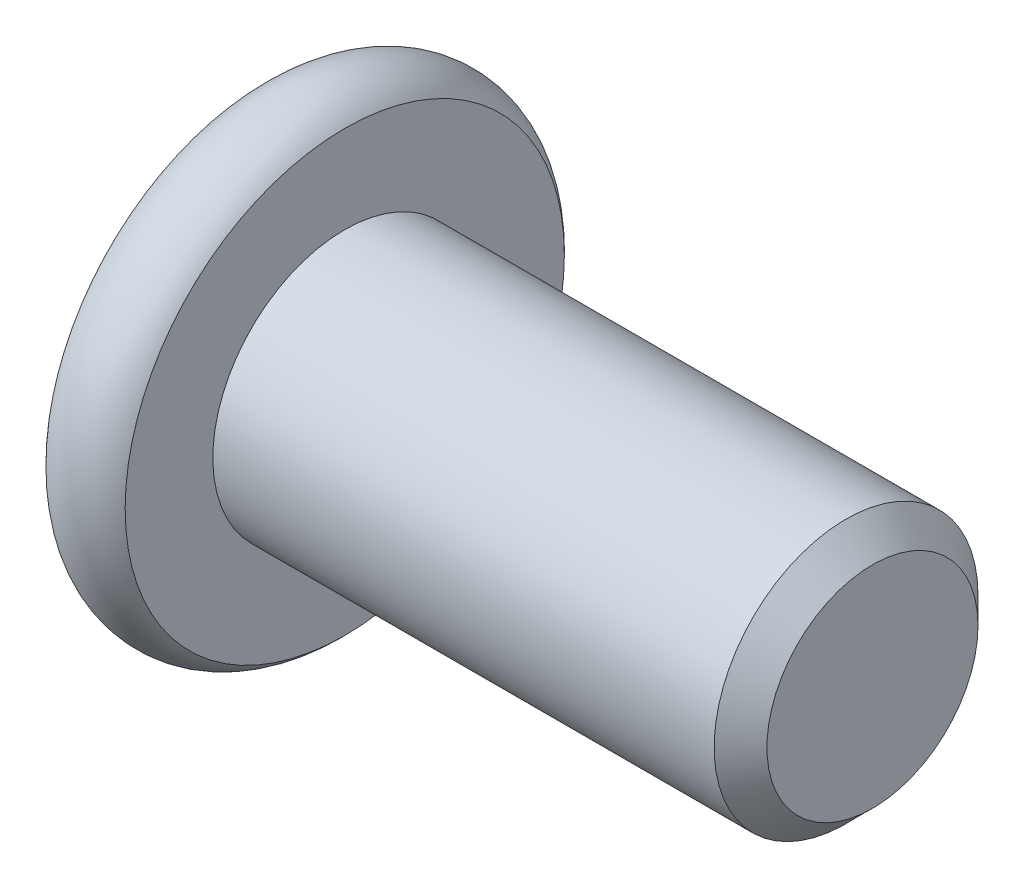
ISO-10303-21;
HEADER;
FILE_DESCRIPTION(('STEP AP214'),'2;1');
FILE_NAME('part.step','',(''),(''),'','','');
FILE_SCHEMA(('AUTOMOTIVE_DESIGN { 1 0 10303 214 1 1 1 1 }'));
ENDSEC;
DATA;
#1=APPLICATION_CONTEXT('core data for automotive mechanical design processes');
#2=APPLICATION_PROTOCOL_DEFINITION('international standard','automotive_design',2000,#1);
#3=PRODUCT_CONTEXT('',#1,'mechanical');
#4=PRODUCT('Part','Part','',(#3));
#5=PRODUCT_RELATED_PRODUCT_CATEGORY('part','',(#4));
#6=PRODUCT_DEFINITION_FORMATION('','',#4);
#7=PRODUCT_DEFINITION_CONTEXT('part definition',#1,'design');
#8=PRODUCT_DEFINITION('design','',#6,#7);
#9=PRODUCT_DEFINITION_SHAPE('','',#8);
#10=(LENGTH_UNIT() NAMED_UNIT(*) SI_UNIT(.MILLI.,.METRE.));
#11=(NAMED_UNIT(*) PLANE_ANGLE_UNIT() SI_UNIT($,.RADIAN.));
#12=(NAMED_UNIT(*) SI_UNIT($,.STERADIAN.) SOLID_ANGLE_UNIT());
#13=UNCERTAINTY_MEASURE_WITH_UNIT(LENGTH_MEASURE(1.E-05),#10,'distance_accuracy_value','');
#14=(GEOMETRIC_REPRESENTATION_CONTEXT(3) GLOBAL_UNCERTAINTY_ASSIGNED_CONTEXT((#13)) GLOBAL_UNIT_ASSIGNED_CONTEXT((#10,
#11,#12)) REPRESENTATION_CONTEXT('',''));
#15=CARTESIAN_POINT('',(0.,0.,0.));
#16=DIRECTION('',(0.,0.,1.));
#17=DIRECTION('',(1.,0.,0.));
#18=AXIS2_PLACEMENT_3D('',#15,#16,#17);
#19=CARTESIAN_POINT('',(-10.,0.,1.11022302462516E-13));
#20=DIRECTION('',(1.,0.,0.));
#21=DIRECTION('',(0.,0.,-1.));
#22=AXIS2_PLACEMENT_3D('',#19,#20,#21);
#23=CYLINDRICAL_SURFACE('',#22,2.5);
#24=CARTESIAN_POINT('',(-0.5,0.,0.));
#25=DIRECTION('',(1.,0.,0.));
#26=DIRECTION('',(0.,0.,-1.));
#27=AXIS2_PLACEMENT_3D('',#24,#25,#26);
#28=CIRCLE('',#27,2.5);
#29=CARTESIAN_POINT('',(-0.5,0.,-2.5));
#30=VERTEX_POINT('',#29);
#31=EDGE_CURVE('E59',#30,#30,#28,.F.);
#32=ORIENTED_EDGE('',*,*,#31,.T.);
#33=EDGE_LOOP('',(#32));
#34=FACE_BOUND('',#33,.T.);
#35=CARTESIAN_POINT('',(-10.,0.,1.11022302462516E-13));
#36=DIRECTION('',(1.,0.,0.));
#37=DIRECTION('',(0.,1.,0.));
#38=AXIS2_PLACEMENT_3D('',#35,#36,#37);
#39=CIRCLE('',#38,2.5);
#40=CARTESIAN_POINT('',(-10.,2.49999999999997,1.09495745803656E-13));
#41=VERTEX_POINT('',#40);
#42=EDGE_CURVE('E135',#41,#41,#39,.F.);
#43=ORIENTED_EDGE('',*,*,#42,.F.);
#44=EDGE_LOOP('',(#43));
#45=FACE_BOUND('',#44,.T.);
#46=ADVANCED_FACE('F45',(#34,#45),#23,.T.);
#47=CARTESIAN_POINT('',(0.,0.,0.));
#48=DIRECTION('',(1.,0.,0.));
#49=DIRECTION('',(0.,0.,-1.));
#50=AXIS2_PLACEMENT_3D('',#47,#48,#49);
#51=PLANE('',#50);
#52=CARTESIAN_POINT('',(0.,0.,0.));
#53=DIRECTION('',(1.,0.,0.));
#54=DIRECTION('',(0.,0.,-1.));
#55=AXIS2_PLACEMENT_3D('',#52,#53,#54);
#56=CIRCLE('',#55,1.99999999999999);
#57=CARTESIAN_POINT('',(0.,0.,-1.99999999999999));
#58=VERTEX_POINT('',#57);
#59=EDGE_CURVE('E138',#58,#58,#56,.T.);
#60=ORIENTED_EDGE('',*,*,#59,.T.);
#61=EDGE_LOOP('',(#60));
#62=FACE_BOUND('',#61,.T.);
#63=ADVANCED_FACE('F148',(#62),#51,.T.);
#64=CARTESIAN_POINT('',(0.,0.,0.));
#65=DIRECTION('',(-1.,0.,0.));
#66=DIRECTION('',(0.,0.,1.));
#67=AXIS2_PLACEMENT_3D('',#64,#65,#66);
#68=CONICAL_SURFACE('',#67,1.99999999999999,0.785398163397446);
#69=ORIENTED_EDGE('',*,*,#31,.F.);
#70=EDGE_LOOP('',(#69));
#71=FACE_BOUND('',#70,.T.);
#72=ORIENTED_EDGE('',*,*,#59,.F.);
#73=EDGE_LOOP('',(#72));
#74=FACE_BOUND('',#73,.T.);
#75=ADVANCED_FACE('F47',(#71,#74),#68,.T.);
#76=CARTESIAN_POINT('',(-11.5,0.,1.11022302462516E-13));
#77=DIRECTION('',(-1.,0.,0.));
#78=DIRECTION('',(0.,-1.,0.));
#79=AXIS2_PLACEMENT_3D('',#76,#77,#78);
#80=PLANE('',#79);
#81=CARTESIAN_POINT('',(-11.5,0.,0.));
#82=DIRECTION('',(-1.,0.,0.));
#83=DIRECTION('',(0.,-1.,0.));
#84=AXIS2_PLACEMENT_3D('',#81,#82,#83);
#85=CIRCLE('',#84,1.78205080756886);
#86=CARTESIAN_POINT('',(-11.5,-1.78205080756884,0.));
#87=VERTEX_POINT('',#86);
#88=EDGE_CURVE('E253',#87,#87,#85,.T.);
#89=ORIENTED_EDGE('',*,*,#88,.F.);
#90=EDGE_LOOP('',(#89));
#91=FACE_BOUND('',#90,.T.);
#92=CARTESIAN_POINT('',(-11.5,0.,1.11022302462516E-13));
#93=DIRECTION('',(1.,0.,0.));
#94=DIRECTION('',(0.,1.,0.));
#95=AXIS2_PLACEMENT_3D('',#92,#93,#94);
#96=CIRCLE('',#95,4.16143782776615);
#97=CARTESIAN_POINT('',(-11.5,4.16143782776612,1.08481234211953E-13));
#98=VERTEX_POINT('',#97);
#99=EDGE_CURVE('E132',#98,#98,#96,.T.);
#100=ORIENTED_EDGE('',*,*,#99,.F.);
#101=EDGE_LOOP('',(#100));
#102=FACE_BOUND('',#101,.T.);
#103=ADVANCED_FACE('F147',(#91,#102),#80,.T.);
#104=CARTESIAN_POINT('',(-10.75,0.,1.11022302462516E-13));
#105=DIRECTION('',(1.,0.,0.));
#106=DIRECTION('',(0.,1.,0.));
#107=AXIS2_PLACEMENT_3D('',#104,#105,#106);
#108=TOROIDAL_SURFACE('',#107,3.5,1.);
#109=ORIENTED_EDGE('',*,*,#99,.T.);
#110=EDGE_LOOP('',(#109));
#111=FACE_BOUND('',#110,.T.);
#112=CARTESIAN_POINT('',(-10.,0.,1.11022302462516E-13));
#113=DIRECTION('',(1.,0.,0.));
#114=DIRECTION('',(0.,1.,0.));
#115=AXIS2_PLACEMENT_3D('',#112,#113,#114);
#116=CIRCLE('',#115,4.16143782776615);
#117=CARTESIAN_POINT('',(-10.,4.16143782776612,1.08481234211953E-13));
#118=VERTEX_POINT('',#117);
#119=EDGE_CURVE('E129',#118,#118,#116,.T.);
#120=ORIENTED_EDGE('',*,*,#119,.F.);
#121=EDGE_LOOP('',(#120));
#122=FACE_BOUND('',#121,.T.);
#123=ADVANCED_FACE('F159',(#111,#122),#108,.T.);
#124=CARTESIAN_POINT('',(-10.,4.16143782776604,0.));
#125=DIRECTION('',(1.,0.,0.));
#126=DIRECTION('',(0.,1.,0.));
#127=AXIS2_PLACEMENT_3D('',#124,#125,#126);
#128=PLANE('',#127);
#129=ORIENTED_EDGE('',*,*,#42,.T.);
#130=EDGE_LOOP('',(#129));
#131=FACE_BOUND('',#130,.T.);
#132=ORIENTED_EDGE('',*,*,#119,.T.);
#133=EDGE_LOOP('',(#132));
#134=FACE_BOUND('',#133,.T.);
#135=ADVANCED_FACE('F163',(#131,#134),#128,.T.);
#136=CARTESIAN_POINT('',(-11.5,0.,0.));
#137=DIRECTION('',(-1.,0.,0.));
#138=DIRECTION('',(0.,-1.,0.));
#139=AXIS2_PLACEMENT_3D('',#136,#137,#138);
#140=CONICAL_SURFACE('',#139,1.78205080756886,0.78539816339745);
#141=ORIENTED_EDGE('',*,*,#88,.T.);
#142=EDGE_LOOP('',(#141));
#143=FACE_BOUND('',#142,.T.);
#144=CARTESIAN_POINT('',(-12.015428085613,-1.74023253176575,1.50000000000006));
#145=CARTESIAN_POINT('',(-11.9833811073445,-1.69791724929728,1.50000000000006));
#146=CARTESIAN_POINT('',(-11.9516444672841,-1.65536760966789,1.50000000000006));
#147=CARTESIAN_POINT('',(-11.8889203936153,-1.56970398156682,1.50000000000006));
#148=CARTESIAN_POINT('',(-11.85793314822,-1.52658985542846,1.50000000000006));
#149=CARTESIAN_POINT('',(-11.765846164345,-1.3956262632656,1.50000000000005));
#150=CARTESIAN_POINT('',(-11.7061145123022,-1.30679868010573,1.50000000000005));
#151=CARTESIAN_POINT('',(-11.5887342891013,-1.12044622640211,1.50000000000007));
#152=CARTESIAN_POINT('',(-11.5314082774823,-1.02271587306667,1.5000000000001));
#153=CARTESIAN_POINT('',(-11.426463214976,-0.822357214965205,1.50000000000001));
#154=CARTESIAN_POINT('',(-11.3788114236896,-0.719746931701875,1.49999999999989));
#155=CARTESIAN_POINT('',(-11.3205099883151,-0.565852387095046,1.49999999999997));
#156=CARTESIAN_POINT('',(-11.303799053541,-0.516874191424634,1.50000000000003));
#157=CARTESIAN_POINT('',(-11.274307751509,-0.417723988457477,1.50000000000008));
#158=CARTESIAN_POINT('',(-11.261527651422,-0.367551900263847,1.50000000000006));
#159=CARTESIAN_POINT('',(-11.2407784202458,-0.267158299056105,1.50000000000005));
#160=CARTESIAN_POINT('',(-11.232726061826,-0.216954261864843,1.50000000000006));
#161=CARTESIAN_POINT('',(-11.2215916368341,-0.115994915871321,1.50000000000006));
#162=CARTESIAN_POINT('',(-11.2185086886377,-0.0652397064615481,1.50000000000006));
#163=CARTESIAN_POINT('',(-11.2175473897404,0.0344222234875365,1.50000000000006));
#164=CARTESIAN_POINT('',(-11.2194789216952,0.0833271701100688,1.50000000000006));
#165=CARTESIAN_POINT('',(-11.2280175729678,0.180724293127204,1.50000000000006));
#166=CARTESIAN_POINT('',(-11.2346251420481,0.229216429361716,1.50000000000006));
#167=CARTESIAN_POINT('',(-11.2522650626448,0.326258027696999,1.50000000000006));
#168=CARTESIAN_POINT('',(-11.2633731682011,0.374793507450018,1.50000000000006));
#169=CARTESIAN_POINT('',(-11.2894198669596,0.470802295834187,1.50000000000006));
#170=CARTESIAN_POINT('',(-11.3043581560035,0.518275688481306,1.50000000000006));
#171=CARTESIAN_POINT('',(-11.3568395457159,0.667150562065167,1.50000000000006));
#172=CARTESIAN_POINT('',(-11.4003351165442,0.766448362426846,1.50000000000006));
#173=CARTESIAN_POINT('',(-11.4970587814837,0.960384405673804,1.50000000000006));
#174=CARTESIAN_POINT('',(-11.5503217226675,1.05500437383619,1.50000000000006));
#175=CARTESIAN_POINT('',(-11.6602258010454,1.23584520321531,1.50000000000006));
#176=CARTESIAN_POINT('',(-11.7165682531047,1.32224986946549,1.50000000000006));
#177=CARTESIAN_POINT('',(-11.8036755725971,1.44954953726472,1.50000000000006));
#178=CARTESIAN_POINT('',(-11.8330199906839,1.49143368482422,1.50000000000006));
#179=CARTESIAN_POINT('',(-11.8924869182931,1.57462914783243,1.50000000000006));
#180=CARTESIAN_POINT('',(-11.9226092115008,1.61594061772578,1.50000000000006));
#181=CARTESIAN_POINT('',(-11.9530541181365,1.65701358742554,1.50000000000006));
#182=B_SPLINE_CURVE_WITH_KNOTS('',3,(#144,#145,#146,#147,#148,#149,#150,#151,#152,#153,#154,
#155,#156,#157,#158,#159,#160,#161,#162,#163,#164,#165,#166,#167,#168,#169,#170,#171,#172,#173,
#174,#175,#176,#177,#178,#179,#180,#181),.UNSPECIFIED.,.F.,.F.,(4,2,2,2,2,2,2,2,2,2,2,2,2,2,2,2,
2,2,4),(0.,0.159238974218347,0.31851753501453,0.639504781932383,0.97913789379921,
1.31760168934358,1.47272233841623,1.62785352839774,1.78016486537344,1.93244917778274,
2.07904486260293,2.22565464958328,2.37484213303396,2.52401777304037,2.8482836528377,
3.17372975666746,3.48303030530534,3.63644667013904,3.78982082222906),.UNSPECIFIED.);
#183=CARTESIAN_POINT('',(-11.45,-0.866025403784415,1.50000000000006));
#184=VERTEX_POINT('',#183);
#185=CARTESIAN_POINT('',(-11.45,0.866025403784554,1.50000000000006));
#186=VERTEX_POINT('',#185);
#187=EDGE_CURVE('E113',#184,#186,#182,.T.);
#188=ORIENTED_EDGE('',*,*,#187,.F.);
#189=CARTESIAN_POINT('',(-11.4501154816001,-1.7321662776226,-0.000200000000005751));
#190=CARTESIAN_POINT('',(-11.4203654760673,-1.70239359975901,0.0513677907370204));
#191=CARTESIAN_POINT('',(-11.3923624839102,-1.67212305186341,0.103797917665136));
#192=CARTESIAN_POINT('',(-11.3410892304401,-1.61039789003607,0.210709034055522));
#193=CARTESIAN_POINT('',(-11.3178475050443,-1.57893740312603,0.265200195814587));
#194=CARTESIAN_POINT('',(-11.2780337289921,-1.51549879897974,0.37507908135714));
#195=CARTESIAN_POINT('',(-11.2613615856708,-1.48353684526794,0.430438809095058));
#196=CARTESIAN_POINT('',(-11.235674456818,-1.41890915196206,0.542377257477066));
#197=CARTESIAN_POINT('',(-11.2266402904789,-1.38624538781127,0.598952556553016));
#198=CARTESIAN_POINT('',(-11.2184890812268,-1.32995210095303,0.696455389516423));
#199=CARTESIAN_POINT('',(-11.2172822529891,-1.30639533311116,0.737256908280385));
#200=CARTESIAN_POINT('',(-11.2193140571621,-1.25932335290178,0.81878796961573));
#201=CARTESIAN_POINT('',(-11.2225536707482,-1.23580815085302,0.859517494314518));
#202=CARTESIAN_POINT('',(-11.2332919859819,-1.18900414978416,0.940584402163311));
#203=CARTESIAN_POINT('',(-11.2407946530186,-1.16571558211706,0.980921384598173));
#204=CARTESIAN_POINT('',(-11.2596516119282,-1.11952932016326,1.06091833691393));
#205=CARTESIAN_POINT('',(-11.2710075570186,-1.09663179808784,1.10057800851613));
#206=CARTESIAN_POINT('',(-11.3047216475927,-1.03798159809701,1.20216313477442));
#207=CARTESIAN_POINT('',(-11.3296218490933,-1.00259267147457,1.26345855370961));
#208=CARTESIAN_POINT('',(-11.3716566532715,-0.950557780604231,1.35358562846322));
#209=CARTESIAN_POINT('',(-11.386425153559,-0.933410759677002,1.38328513990763));
#210=CARTESIAN_POINT('',(-11.4173105659401,-0.899432101996304,1.44213790138367));
#211=CARTESIAN_POINT('',(-11.4334268341217,-0.882600319285652,1.47129140422057));
#212=CARTESIAN_POINT('',(-11.4501154816001,-0.865909933730619,1.50019999999995));
#213=B_SPLINE_CURVE_WITH_KNOTS('',3,(#189,#190,#191,#192,#193,#194,#195,#196,#197,#198,#199,
#200,#201,#202,#203,#204,#205,#206,#207,#208,#209,#210,#211,#212),.UNSPECIFIED.,.F.,.F.,(4,2,2,
2,2,2,2,2,2,2,2,4),(0.,0.199829143693317,0.400822987382368,0.598623720538134,0.79592624018884,
0.937113067959841,1.07833105577188,1.21968061668217,1.3610908993105,1.58570969637562,
1.6977070547096,1.80965120737191),.UNSPECIFIED.);
#214=CARTESIAN_POINT('',(-11.45,-1.73205080756877,-1.11022302462516E-13));
#215=VERTEX_POINT('',#214);
#216=EDGE_CURVE('E209',#215,#184,#213,.T.);
#217=ORIENTED_EDGE('',*,*,#216,.F.);
#218=CARTESIAN_POINT('',(-11.4501154816001,-0.865909933730619,-1.50020000000006));
#219=CARTESIAN_POINT('',(-11.4203654760674,-0.895682611594177,-1.44863220926296));
#220=CARTESIAN_POINT('',(-11.3923624839104,-0.925953159489773,-1.39620208233483));
#221=CARTESIAN_POINT('',(-11.3410892304402,-0.987678321317133,-1.28929096594443));
#222=CARTESIAN_POINT('',(-11.3178475050444,-1.01913880822719,-1.23479980418536));
#223=CARTESIAN_POINT('',(-11.2780337289923,-1.08257741237346,-1.12492091864276));
#224=CARTESIAN_POINT('',(-11.261361585671,-1.11453936608523,-1.0695611909048));
#225=CARTESIAN_POINT('',(-11.2356744568182,-1.17916705939123,-0.957622742522851));
#226=CARTESIAN_POINT('',(-11.2266402904789,-1.21183082354217,-0.901047443447003));
#227=CARTESIAN_POINT('',(-11.2184890812269,-1.26812411040036,-0.80354461048357));
#228=CARTESIAN_POINT('',(-11.2172822529893,-1.2916808782421,-0.762743091719539));
#229=CARTESIAN_POINT('',(-11.2193140571624,-1.3387528584514,-0.68121203038414));
#230=CARTESIAN_POINT('',(-11.2225536707484,-1.36226806050021,-0.640482505685366));
#231=CARTESIAN_POINT('',(-11.233291985982,-1.40907206156908,-0.559415597836582));
#232=CARTESIAN_POINT('',(-11.2407946530188,-1.43236062923615,-0.519078615401713));
#233=CARTESIAN_POINT('',(-11.2596516119284,-1.47854689118999,-0.439081663085956));
#234=CARTESIAN_POINT('',(-11.2710075570186,-1.50144441326547,-0.39942199148376));
#235=CARTESIAN_POINT('',(-11.3047216475927,-1.56009461325633,-0.297836865225488));
#236=CARTESIAN_POINT('',(-11.3296218490934,-1.59548353987867,-0.236541446290331));
#237=CARTESIAN_POINT('',(-11.3716566532716,-1.64751843074894,-0.146414371536733));
#238=CARTESIAN_POINT('',(-11.3864251535592,-1.66466545167616,-0.11671486009233));
#239=CARTESIAN_POINT('',(-11.4173105659402,-1.69864410935691,-0.05786209861631));
#240=CARTESIAN_POINT('',(-11.4334268341217,-1.71547589206762,-0.0287085957794369));
#241=CARTESIAN_POINT('',(-11.4501154816001,-1.73216627762277,0.000199999999894729));
#242=B_SPLINE_CURVE_WITH_KNOTS('',3,(#218,#219,#220,#221,#222,#223,#224,#225,#226,#227,#228,
#229,#230,#231,#232,#233,#234,#235,#236,#237,#238,#239,#240,#241),.UNSPECIFIED.,.F.,.F.,(4,2,2,
2,2,2,2,2,2,2,2,4),(0.,0.199829143693295,0.400822987382397,0.598623720538208,0.795926240188921,
0.937113067959911,1.07833105577197,1.21968061668226,1.36109089931059,1.58570969637565,
1.69770705470961,1.80965120737188),.UNSPECIFIED.);
#243=CARTESIAN_POINT('',(-11.45,-0.866025403784471,-1.5));
#244=VERTEX_POINT('',#243);
#245=EDGE_CURVE('E203',#244,#215,#242,.T.);
#246=ORIENTED_EDGE('',*,*,#245,.F.);
#247=CARTESIAN_POINT('',(-12.015428085613,-1.74023253176578,-1.49999999999989));
#248=CARTESIAN_POINT('',(-11.9833811073445,-1.69791724929732,-1.49999999999993));
#249=CARTESIAN_POINT('',(-11.951644467284,-1.65536760966794,-1.49999999999994));
#250=CARTESIAN_POINT('',(-11.8889203936153,-1.56970398156688,-1.49999999999995));
#251=CARTESIAN_POINT('',(-11.85793314822,-1.52658985542852,-1.49999999999995));
#252=CARTESIAN_POINT('',(-11.765846164345,-1.39562626326567,-1.49999999999994));
#253=CARTESIAN_POINT('',(-11.7061145123021,-1.30679868010581,-1.49999999999995));
#254=CARTESIAN_POINT('',(-11.5887342891012,-1.12044622640222,-1.49999999999995));
#255=CARTESIAN_POINT('',(-11.5314082774822,-1.0227158730668,-1.49999999999995));
#256=CARTESIAN_POINT('',(-11.426463214976,-0.822357214965339,-1.49999999999995));
#257=CARTESIAN_POINT('',(-11.3788114236896,-0.719746931701999,-1.49999999999995));
#258=CARTESIAN_POINT('',(-11.320509988315,-0.565852387095178,-1.49999999999995));
#259=CARTESIAN_POINT('',(-11.3037990535409,-0.516874191424764,-1.49999999999995));
#260=CARTESIAN_POINT('',(-11.2743077515089,-0.417723988457595,-1.49999999999995));
#261=CARTESIAN_POINT('',(-11.2615276514219,-0.367551900263956,-1.49999999999995));
#262=CARTESIAN_POINT('',(-11.2407784202457,-0.267158299056196,-1.49999999999995));
#263=CARTESIAN_POINT('',(-11.2327260618259,-0.216954261864928,-1.49999999999995));
#264=CARTESIAN_POINT('',(-11.221591636834,-0.115994915871382,-1.49999999999995));
#265=CARTESIAN_POINT('',(-11.2185086886377,-0.065239706461592,-1.49999999999995));
#266=CARTESIAN_POINT('',(-11.2175473897404,0.0344222234875099,-1.49999999999995));
#267=CARTESIAN_POINT('',(-11.2194789216951,0.0833271701100426,-1.49999999999995));
#268=CARTESIAN_POINT('',(-11.2280175729676,0.18072429312717,-1.49999999999995));
#269=CARTESIAN_POINT('',(-11.234625142048,0.229216429361673,-1.49999999999994));
#270=CARTESIAN_POINT('',(-11.2522650626446,0.326258027696948,-1.49999999999995));
#271=CARTESIAN_POINT('',(-11.2633731682009,0.374793507449967,-1.49999999999996));
#272=CARTESIAN_POINT('',(-11.2894198669595,0.470802295834111,-1.49999999999993));
#273=CARTESIAN_POINT('',(-11.3043581560035,0.518275688481205,-1.4999999999999));
#274=CARTESIAN_POINT('',(-11.356839545716,0.667150562065055,-1.49999999999986));
#275=CARTESIAN_POINT('',(-11.4003351165441,0.7664483624268,-1.49999999999992));
#276=CARTESIAN_POINT('',(-11.4970587814836,0.960384405673815,-1.49999999999997));
#277=CARTESIAN_POINT('',(-11.5503217226674,1.05500437383619,-1.49999999999995));
#278=CARTESIAN_POINT('',(-11.6602258010453,1.2358452032153,-1.49999999999994));
#279=CARTESIAN_POINT('',(-11.7165682531046,1.32224986946549,-1.49999999999996));
#280=CARTESIAN_POINT('',(-11.803675572597,1.44954953726473,-1.49999999999994));
#281=CARTESIAN_POINT('',(-11.8330199906839,1.49143368482423,-1.49999999999992));
#282=CARTESIAN_POINT('',(-11.892486918293,1.57462914783245,-1.49999999999997));
#283=CARTESIAN_POINT('',(-11.9226092115007,1.6159406177258,-1.50000000000003));
#284=CARTESIAN_POINT('',(-11.9530541181365,1.65701358742554,-1.50000000000017));
#285=B_SPLINE_CURVE_WITH_KNOTS('',3,(#247,#248,#249,#250,#251,#252,#253,#254,#255,#256,#257,
#258,#259,#260,#261,#262,#263,#264,#265,#266,#267,#268,#269,#270,#271,#272,#273,#274,#275,#276,
#277,#278,#279,#280,#281,#282,#283,#284),.UNSPECIFIED.,.F.,.F.,(4,2,2,2,2,2,2,2,2,2,2,2,2,2,2,2,
2,2,4),(0.,0.159238974218347,0.318517535014527,0.639504781932345,0.979137893799135,
1.31760168934349,1.47272233841618,1.62785352839772,1.78016486537344,1.93244917778278,
2.07904486260296,2.2256546495833,2.37484213303396,2.52401777304036,2.84828365283775,
3.17372975666752,3.4830303053054,3.63644667013912,3.78982082222918),.UNSPECIFIED.);
#286=CARTESIAN_POINT('',(-11.45,0.866025403784554,-1.49999999999995));
#287=VERTEX_POINT('',#286);
#288=EDGE_CURVE('E66',#287,#244,#285,.F.);
#289=ORIENTED_EDGE('',*,*,#288,.F.);
#290=CARTESIAN_POINT('',(-11.4501154816001,1.73216627762277,0.000199999999894729));
#291=CARTESIAN_POINT('',(-11.4203654760673,1.70239359975916,-0.05136779073714));
#292=CARTESIAN_POINT('',(-11.3923624839103,1.67212305186355,-0.103797917665247));
#293=CARTESIAN_POINT('',(-11.3410892304401,1.61039789003619,-0.210709034055624));
#294=CARTESIAN_POINT('',(-11.3178475050444,1.57893740312615,-0.265200195814687));
#295=CARTESIAN_POINT('',(-11.2780337289922,1.51549879897988,-0.375079081357258));
#296=CARTESIAN_POINT('',(-11.2613615856709,1.4835368452681,-0.430438809095192));
#297=CARTESIAN_POINT('',(-11.2356744568181,1.41890915196216,-0.542377257477142));
#298=CARTESIAN_POINT('',(-11.2266402904789,1.38624538781127,-0.598952556553014));
#299=CARTESIAN_POINT('',(-11.2184890812269,1.32995210095308,-0.696455389516429));
#300=CARTESIAN_POINT('',(-11.2172822529892,1.30639533311129,-0.737256908280437));
#301=CARTESIAN_POINT('',(-11.2193140571623,1.25932335290196,-0.818787969615818));
#302=CARTESIAN_POINT('',(-11.2225536707483,1.23580815085316,-0.859517494314596));
#303=CARTESIAN_POINT('',(-11.233291985982,1.1890041497843,-0.94058440216339));
#304=CARTESIAN_POINT('',(-11.2407946530187,1.16571558211723,-0.980921384598263));
#305=CARTESIAN_POINT('',(-11.2596516119283,1.11952932016338,-1.06091833691401));
#306=CARTESIAN_POINT('',(-11.2710075570186,1.09663179808789,-1.10057800851619));
#307=CARTESIAN_POINT('',(-11.3047216475927,1.03798159809701,-1.20216313477448));
#308=CARTESIAN_POINT('',(-11.3296218490934,1.00259267147468,-1.26345855370971));
#309=CARTESIAN_POINT('',(-11.3716566532716,0.950557780604371,-1.35358562846334));
#310=CARTESIAN_POINT('',(-11.3864251535591,0.93341075967713,-1.38328513990774));
#311=CARTESIAN_POINT('',(-11.4173105659402,0.899432101996418,-1.4421379013838));
#312=CARTESIAN_POINT('',(-11.4334268341217,0.882600319285763,-1.47129140422073));
#313=CARTESIAN_POINT('',(-11.4501154816001,0.865909933730757,-1.50020000000017));
#314=B_SPLINE_CURVE_WITH_KNOTS('',3,(#290,#291,#292,#293,#294,#295,#296,#297,#298,#299,#300,
#301,#302,#303,#304,#305,#306,#307,#308,#309,#310,#311,#312,#313),.UNSPECIFIED.,.F.,.F.,(4,2,2,
2,2,2,2,2,2,2,2,4),(0.,0.19982914369328,0.400822987382342,0.598623720538101,0.795926240188776,
0.937113067959772,1.07833105577182,1.21968061668212,1.36109089931045,1.58570969637561,
1.69770705470961,1.80965120737193),.UNSPECIFIED.);
#315=CARTESIAN_POINT('',(-11.45,1.73205080756883,0.));
#316=VERTEX_POINT('',#315);
#317=EDGE_CURVE('E13',#316,#287,#314,.T.);
#318=ORIENTED_EDGE('',*,*,#317,.F.);
#319=CARTESIAN_POINT('',(-11.4501154816001,0.865909933730619,1.5001999999999));
#320=CARTESIAN_POINT('',(-11.4203654760674,0.895682611594288,1.44863220926288));
#321=CARTESIAN_POINT('',(-11.3923624839104,0.925953159489916,1.39620208233479));
#322=CARTESIAN_POINT('',(-11.3410892304402,0.987678321317283,1.28929096594442));
#323=CARTESIAN_POINT('',(-11.3178475050445,1.01913880822732,1.23479980418535));
#324=CARTESIAN_POINT('',(-11.2780337289923,1.08257741237359,1.12492091864278));
#325=CARTESIAN_POINT('',(-11.2613615856711,1.11453936608538,1.06956119090486));
#326=CARTESIAN_POINT('',(-11.2356744568182,1.17916705939128,0.957622742522905));
#327=CARTESIAN_POINT('',(-11.2266402904789,1.21183082354211,0.901047443447026));
#328=CARTESIAN_POINT('',(-11.2184890812269,1.26812411040031,0.803544610483633));
#329=CARTESIAN_POINT('',(-11.2172822529893,1.29168087824214,0.762743091719643));
#330=CARTESIAN_POINT('',(-11.2193140571624,1.33875285845149,0.681212030384269));
#331=CARTESIAN_POINT('',(-11.2225536707484,1.36226806050028,0.640482505685479));
#332=CARTESIAN_POINT('',(-11.2332919859821,1.40907206156914,0.559415597836681));
#333=CARTESIAN_POINT('',(-11.2407946530189,1.43236062923623,0.519078615401816));
#334=CARTESIAN_POINT('',(-11.2596516119284,1.47854689119006,0.439081663086041));
#335=CARTESIAN_POINT('',(-11.2710075570186,1.50144441326553,0.399421991483824));
#336=CARTESIAN_POINT('',(-11.3047216475927,1.5600946132564,0.297836865225513));
#337=CARTESIAN_POINT('',(-11.3296218490934,1.59548353987878,0.236541446290358));
#338=CARTESIAN_POINT('',(-11.3716566532717,1.64751843074907,0.146414371536745));
#339=CARTESIAN_POINT('',(-11.3864251535592,1.6646654516763,0.116714860092334));
#340=CARTESIAN_POINT('',(-11.4173105659403,1.69864410935705,0.0578620986162786));
#341=CARTESIAN_POINT('',(-11.4334268341218,1.71547589206776,0.0287085957793762));
#342=CARTESIAN_POINT('',(-11.4501154816001,1.7321662776229,-0.000200000000005751));
#343=B_SPLINE_CURVE_WITH_KNOTS('',3,(#319,#320,#321,#322,#323,#324,#325,#326,#327,#328,#329,
#330,#331,#332,#333,#334,#335,#336,#337,#338,#339,#340,#341,#342),.UNSPECIFIED.,.F.,.F.,(4,2,2,
2,2,2,2,2,2,2,2,4),(0.,0.199829143693237,0.400822987382304,0.598623720538056,0.795926240188697,
0.93711306795969,1.07833105577176,1.21968061668207,1.3610908993104,1.58570969637555,
1.69770705470955,1.80965120737186),.UNSPECIFIED.);
#344=EDGE_CURVE('E104',#186,#316,#343,.T.);
#345=ORIENTED_EDGE('',*,*,#344,.F.);
#346=EDGE_LOOP('',(#188,#217,#246,#289,#318,#345));
#347=FACE_BOUND('',#346,.T.);
#348=ADVANCED_FACE('F103',(#143,#347),#140,.F.);
#349=CARTESIAN_POINT('',(-9.19999999999999,0.,0.));
#350=DIRECTION('',(-1.,0.,0.));
#351=DIRECTION('',(0.,-1.,0.));
#352=AXIS2_PLACEMENT_3D('',#349,#350,#351);
#353=PLANE('',#352);
#354=DIRECTION('',(0.,0.5,-0.866025403784438));
#355=VECTOR('',#354,1.);
#356=CARTESIAN_POINT('',(-9.19999999999999,0.866025403784554,1.50000000000006));
#357=LINE('',#356,#355);
#358=CARTESIAN_POINT('',(-9.19999999999999,0.866025403784554,1.50000000000006));
#359=VERTEX_POINT('',#358);
#360=CARTESIAN_POINT('',(-9.19999999999999,1.73205080756889,0.));
#361=VERTEX_POINT('',#360);
#362=EDGE_CURVE('E112',#359,#361,#357,.T.);
#363=ORIENTED_EDGE('',*,*,#362,.T.);
#364=DIRECTION('',(0.,-0.499999999999999,-0.866025403784438));
#365=VECTOR('',#364,1.);
#366=CARTESIAN_POINT('',(-9.19999999999999,1.73205080756889,0.));
#367=LINE('',#366,#365);
#368=CARTESIAN_POINT('',(-9.19999999999999,0.86602540378436,-1.49999999999995));
#369=VERTEX_POINT('',#368);
#370=EDGE_CURVE('E117',#361,#369,#367,.T.);
#371=ORIENTED_EDGE('',*,*,#370,.T.);
#372=DIRECTION('',(0.,-1.,0.));
#373=VECTOR('',#372,1.);
#374=CARTESIAN_POINT('',(-9.19999999999999,0.86602540378436,-1.49999999999995));
#375=LINE('',#374,#373);
#376=CARTESIAN_POINT('',(-9.20000000000001,-0.866025403784471,-1.5));
#377=VERTEX_POINT('',#376);
#378=EDGE_CURVE('E235',#369,#377,#375,.T.);
#379=ORIENTED_EDGE('',*,*,#378,.T.);
#380=DIRECTION('',(0.,-0.5,0.866025403784438));
#381=VECTOR('',#380,1.);
#382=CARTESIAN_POINT('',(-9.20000000000001,-0.866025403784471,-1.5));
#383=LINE('',#382,#381);
#384=CARTESIAN_POINT('',(-9.20000000000001,-1.73205080756877,-1.11022302462516E-13));
#385=VERTEX_POINT('',#384);
#386=EDGE_CURVE('E239',#377,#385,#383,.T.);
#387=ORIENTED_EDGE('',*,*,#386,.T.);
#388=DIRECTION('',(0.,0.499999999999999,0.866025403784438));
#389=VECTOR('',#388,1.);
#390=CARTESIAN_POINT('',(-9.20000000000001,-1.73205080756877,-1.11022302462516E-13));
#391=LINE('',#390,#389);
#392=CARTESIAN_POINT('',(-9.20000000000001,-0.866025403784415,1.50000000000006));
#393=VERTEX_POINT('',#392);
#394=EDGE_CURVE('E125',#385,#393,#391,.T.);
#395=ORIENTED_EDGE('',*,*,#394,.T.);
#396=DIRECTION('',(0.,1.,0.));
#397=VECTOR('',#396,1.);
#398=CARTESIAN_POINT('',(-9.20000000000001,-0.866025403784415,1.50000000000006));
#399=LINE('',#398,#397);
#400=EDGE_CURVE('E120',#393,#359,#399,.T.);
#401=ORIENTED_EDGE('',*,*,#400,.T.);
#402=EDGE_LOOP('',(#363,#371,#379,#387,#395,#401));
#403=FACE_BOUND('',#402,.T.);
#404=ADVANCED_FACE('F189',(#403),#353,.T.);
#405=CARTESIAN_POINT('',(-9.19999999999999,1.73205080756889,0.));
#406=DIRECTION('',(0.,0.866025403784439,-0.5));
#407=DIRECTION('',(0.,0.499999999999999,0.866025403784439));
#408=AXIS2_PLACEMENT_3D('',#405,#406,#407);
#409=PLANE('',#408);
#410=DIRECTION('',(-1.,0.,0.));
#411=VECTOR('',#410,1.);
#412=CARTESIAN_POINT('',(-9.19999999999999,1.73205080756889,0.));
#413=LINE('',#412,#411);
#414=EDGE_CURVE('E110',#361,#316,#413,.T.);
#415=ORIENTED_EDGE('',*,*,#414,.T.);
#416=ORIENTED_EDGE('',*,*,#317,.T.);
#417=DIRECTION('',(-1.,0.,0.));
#418=VECTOR('',#417,1.);
#419=CARTESIAN_POINT('',(-9.19999999999999,0.86602540378436,-1.49999999999995));
#420=LINE('',#419,#418);
#421=EDGE_CURVE('E119',#369,#287,#420,.T.);
#422=ORIENTED_EDGE('',*,*,#421,.F.);
#423=ORIENTED_EDGE('',*,*,#370,.F.);
#424=EDGE_LOOP('',(#415,#416,#422,#423));
#425=FACE_BOUND('',#424,.T.);
#426=ADVANCED_FACE('F115',(#425),#409,.F.);
#427=CARTESIAN_POINT('',(-9.19999999999999,0.86602540378436,-1.49999999999995));
#428=DIRECTION('',(0.,0.,-1.));
#429=DIRECTION('',(-1.,0.,0.));
#430=AXIS2_PLACEMENT_3D('',#427,#428,#429);
#431=PLANE('',#430);
#432=ORIENTED_EDGE('',*,*,#421,.T.);
#433=ORIENTED_EDGE('',*,*,#288,.T.);
#434=DIRECTION('',(-1.,0.,0.));
#435=VECTOR('',#434,1.);
#436=CARTESIAN_POINT('',(-9.20000000000001,-0.866025403784471,-1.5));
#437=LINE('',#436,#435);
#438=EDGE_CURVE('E122',#377,#244,#437,.T.);
#439=ORIENTED_EDGE('',*,*,#438,.F.);
#440=ORIENTED_EDGE('',*,*,#378,.F.);
#441=EDGE_LOOP('',(#432,#433,#439,#440));
#442=FACE_BOUND('',#441,.T.);
#443=ADVANCED_FACE('F224',(#442),#431,.F.);
#444=CARTESIAN_POINT('',(-9.20000000000001,-0.866025403784471,-1.5));
#445=DIRECTION('',(0.,-0.866025403784438,-0.5));
#446=DIRECTION('',(0.,0.5,-0.866025403784438));
#447=AXIS2_PLACEMENT_3D('',#444,#445,#446);
#448=PLANE('',#447);
#449=ORIENTED_EDGE('',*,*,#438,.T.);
#450=ORIENTED_EDGE('',*,*,#245,.T.);
#451=DIRECTION('',(-1.,0.,0.));
#452=VECTOR('',#451,1.);
#453=CARTESIAN_POINT('',(-9.20000000000001,-1.73205080756877,-1.11022302462516E-13));
#454=LINE('',#453,#452);
#455=EDGE_CURVE('E249',#385,#215,#454,.T.);
#456=ORIENTED_EDGE('',*,*,#455,.F.);
#457=ORIENTED_EDGE('',*,*,#386,.F.);
#458=EDGE_LOOP('',(#449,#450,#456,#457));
#459=FACE_BOUND('',#458,.T.);
#460=ADVANCED_FACE('F219',(#459),#448,.F.);
#461=CARTESIAN_POINT('',(-9.20000000000001,-1.73205080756877,-1.11022302462516E-13));
#462=DIRECTION('',(0.,-0.866025403784439,0.5));
#463=DIRECTION('',(0.,-0.499999999999999,-0.866025403784438));
#464=AXIS2_PLACEMENT_3D('',#461,#462,#463);
#465=PLANE('',#464);
#466=ORIENTED_EDGE('',*,*,#455,.T.);
#467=ORIENTED_EDGE('',*,*,#216,.T.);
#468=DIRECTION('',(-1.,0.,0.));
#469=VECTOR('',#468,1.);
#470=CARTESIAN_POINT('',(-9.20000000000001,-0.866025403784415,1.50000000000006));
#471=LINE('',#470,#469);
#472=EDGE_CURVE('E246',#393,#184,#471,.T.);
#473=ORIENTED_EDGE('',*,*,#472,.F.);
#474=ORIENTED_EDGE('',*,*,#394,.F.);
#475=EDGE_LOOP('',(#466,#467,#473,#474));
#476=FACE_BOUND('',#475,.T.);
#477=ADVANCED_FACE('F216',(#476),#465,.F.);
#478=CARTESIAN_POINT('',(-9.20000000000001,-0.866025403784415,1.50000000000006));
#479=DIRECTION('',(0.,0.,1.));
#480=DIRECTION('',(1.,0.,0.));
#481=AXIS2_PLACEMENT_3D('',#478,#479,#480);
#482=PLANE('',#481);
#483=ORIENTED_EDGE('',*,*,#472,.T.);
#484=ORIENTED_EDGE('',*,*,#187,.T.);
#485=DIRECTION('',(-1.,0.,0.));
#486=VECTOR('',#485,1.);
#487=CARTESIAN_POINT('',(-9.19999999999999,0.866025403784554,1.50000000000006));
#488=LINE('',#487,#486);
#489=EDGE_CURVE('E73',#359,#186,#488,.T.);
#490=ORIENTED_EDGE('',*,*,#489,.F.);
#491=ORIENTED_EDGE('',*,*,#400,.F.);
#492=EDGE_LOOP('',(#483,#484,#490,#491));
#493=FACE_BOUND('',#492,.T.);
#494=ADVANCED_FACE('F170',(#493),#482,.F.);
#495=CARTESIAN_POINT('',(-9.19999999999999,0.866025403784554,1.50000000000006));
#496=DIRECTION('',(0.,0.866025403784438,0.5));
#497=DIRECTION('',(0.,-0.5,0.866025403784438));
#498=AXIS2_PLACEMENT_3D('',#495,#496,#497);
#499=PLANE('',#498);
#500=ORIENTED_EDGE('',*,*,#489,.T.);
#501=ORIENTED_EDGE('',*,*,#344,.T.);
#502=ORIENTED_EDGE('',*,*,#414,.F.);
#503=ORIENTED_EDGE('',*,*,#362,.F.);
#504=EDGE_LOOP('',(#500,#501,#502,#503));
#505=FACE_BOUND('',#504,.T.);
#506=ADVANCED_FACE('F109',(#505),#499,.F.);
#507=CLOSED_SHELL('',(#46,#63,#75,#103,#123,#135,#348,#404,#426,#443,#460,#477,#494,#506));
#508=MANIFOLD_SOLID_BREP('B2',#507);
#509=ADVANCED_BREP_SHAPE_REPRESENTATION('',(#18,#508),#14);
#510=SHAPE_DEFINITION_REPRESENTATION(#9,#509);
ENDSEC;
END-ISO-10303-21;
